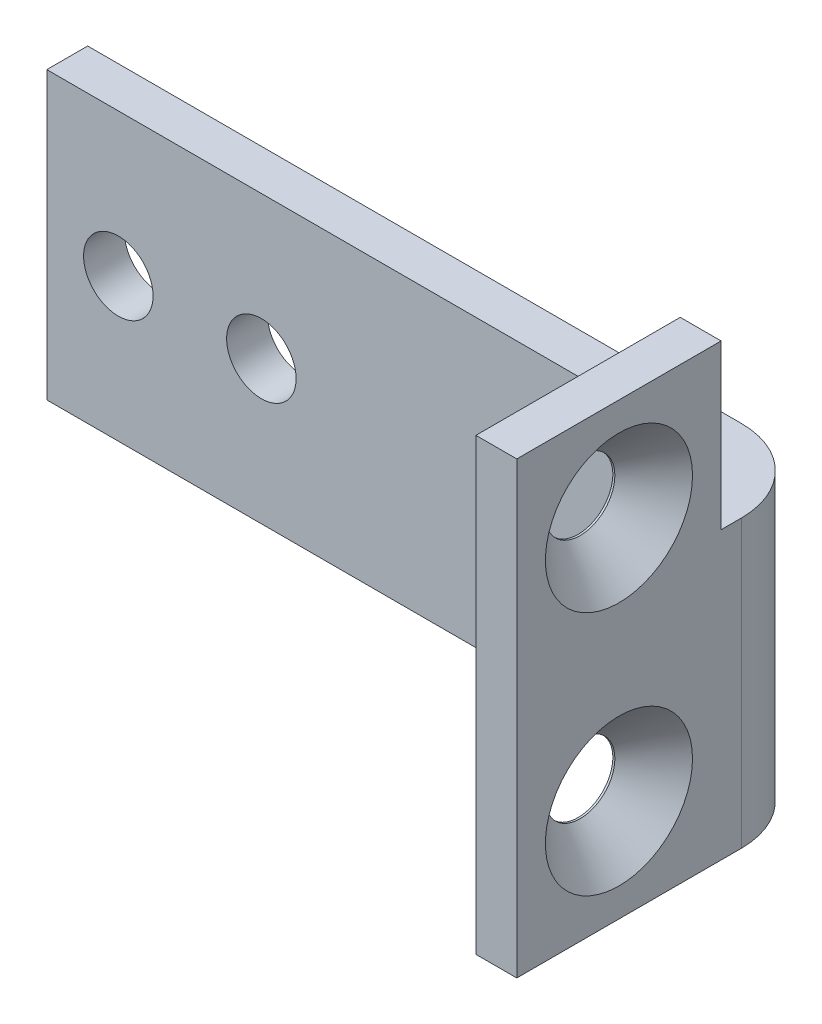
ISO-10303-21;
HEADER;
FILE_DESCRIPTION(('STEP AP214'),'2;1');
FILE_NAME('part.step','',(''),(''),'','','');
FILE_SCHEMA(('AUTOMOTIVE_DESIGN { 1 0 10303 214 1 1 1 1 }'));
ENDSEC;
DATA;
#1=APPLICATION_CONTEXT('core data for automotive mechanical design processes');
#2=APPLICATION_PROTOCOL_DEFINITION('international standard','automotive_design',2000,#1);
#3=PRODUCT_CONTEXT('',#1,'mechanical');
#4=PRODUCT('Part','Part','',(#3));
#5=PRODUCT_RELATED_PRODUCT_CATEGORY('part','',(#4));
#6=PRODUCT_DEFINITION_FORMATION('','',#4);
#7=PRODUCT_DEFINITION_CONTEXT('part definition',#1,'design');
#8=PRODUCT_DEFINITION('design','',#6,#7);
#9=PRODUCT_DEFINITION_SHAPE('','',#8);
#10=(LENGTH_UNIT() NAMED_UNIT(*) SI_UNIT(.MILLI.,.METRE.));
#11=(NAMED_UNIT(*) PLANE_ANGLE_UNIT() SI_UNIT($,.RADIAN.));
#12=(NAMED_UNIT(*) SI_UNIT($,.STERADIAN.) SOLID_ANGLE_UNIT());
#13=UNCERTAINTY_MEASURE_WITH_UNIT(LENGTH_MEASURE(1.E-05),#10,'distance_accuracy_value','');
#14=(GEOMETRIC_REPRESENTATION_CONTEXT(3) GLOBAL_UNCERTAINTY_ASSIGNED_CONTEXT((#13)) GLOBAL_UNIT_ASSIGNED_CONTEXT((#10,
#11,#12)) REPRESENTATION_CONTEXT('',''));
#15=CARTESIAN_POINT('',(0.,0.,0.));
#16=DIRECTION('',(0.,0.,1.));
#17=DIRECTION('',(1.,0.,0.));
#18=AXIS2_PLACEMENT_3D('',#15,#16,#17);
#19=CARTESIAN_POINT('',(17.9,-2.,9.));
#20=DIRECTION('',(-1.,0.,0.));
#21=DIRECTION('',(0.,0.,1.));
#22=AXIS2_PLACEMENT_3D('',#19,#20,#21);
#23=CYLINDRICAL_SURFACE('',#22,1.7);
#24=CARTESIAN_POINT('',(16.0999999999945,-2.,9.));
#25=DIRECTION('',(1.,0.,0.));
#26=DIRECTION('',(0.,0.877582561884015,-0.479425538615841));
#27=AXIS2_PLACEMENT_3D('',#24,#25,#26);
#28=CIRCLE('',#27,1.70000000001516);
#29=CARTESIAN_POINT('',(16.0999999999945,-0.508109644783872,8.1849765843458));
#30=VERTEX_POINT('',#29);
#31=EDGE_CURVE('E155',#30,#30,#28,.T.);
#32=ORIENTED_EDGE('',*,*,#31,.T.);
#33=EDGE_LOOP('',(#32));
#34=FACE_BOUND('',#33,.T.);
#35=CARTESIAN_POINT('',(16.,-2.,9.));
#36=DIRECTION('',(-1.,0.,0.));
#37=DIRECTION('',(0.,0.,1.));
#38=AXIS2_PLACEMENT_3D('',#35,#36,#37);
#39=CIRCLE('',#38,1.7);
#40=CARTESIAN_POINT('',(16.,-2.,10.7));
#41=VERTEX_POINT('',#40);
#42=EDGE_CURVE('E18',#41,#41,#39,.T.);
#43=ORIENTED_EDGE('',*,*,#42,.T.);
#44=EDGE_LOOP('',(#43));
#45=FACE_BOUND('',#44,.T.);
#46=ADVANCED_FACE('F15',(#34,#45),#23,.F.);
#47=CARTESIAN_POINT('',(17.9,10.,9.));
#48=DIRECTION('',(-1.,0.,0.));
#49=DIRECTION('',(0.,0.,1.));
#50=AXIS2_PLACEMENT_3D('',#47,#48,#49);
#51=CYLINDRICAL_SURFACE('',#50,1.7);
#52=CARTESIAN_POINT('',(16.0999999999945,10.,9.));
#53=DIRECTION('',(1.,0.,0.));
#54=DIRECTION('',(0.,0.877582561884077,-0.479425538615728));
#55=AXIS2_PLACEMENT_3D('',#52,#53,#54);
#56=CIRCLE('',#55,1.70000000001556);
#57=CARTESIAN_POINT('',(16.0999999999945,11.4918903552166,8.1849765843458));
#58=VERTEX_POINT('',#57);
#59=EDGE_CURVE('E152',#58,#58,#56,.T.);
#60=ORIENTED_EDGE('',*,*,#59,.T.);
#61=EDGE_LOOP('',(#60));
#62=FACE_BOUND('',#61,.T.);
#63=CARTESIAN_POINT('',(16.,10.,9.));
#64=DIRECTION('',(-1.,0.,0.));
#65=DIRECTION('',(0.,0.,1.));
#66=AXIS2_PLACEMENT_3D('',#63,#64,#65);
#67=CIRCLE('',#66,1.7);
#68=CARTESIAN_POINT('',(16.,10.,10.7));
#69=VERTEX_POINT('',#68);
#70=EDGE_CURVE('E129',#69,#69,#67,.T.);
#71=ORIENTED_EDGE('',*,*,#70,.T.);
#72=EDGE_LOOP('',(#71));
#73=FACE_BOUND('',#72,.T.);
#74=ADVANCED_FACE('F235',(#62,#73),#51,.F.);
#75=CARTESIAN_POINT('',(0.,15.,0.));
#76=DIRECTION('',(0.,-1.,0.));
#77=DIRECTION('',(0.,0.,-1.));
#78=AXIS2_PLACEMENT_3D('',#75,#76,#77);
#79=PLANE('',#78);
#80=DIRECTION('',(0.,0.,-1.));
#81=VECTOR('',#80,1.);
#82=CARTESIAN_POINT('',(16.,15.,3.));
#83=LINE('',#82,#81);
#84=CARTESIAN_POINT('',(16.,15.,4.));
#85=VERTEX_POINT('',#84);
#86=CARTESIAN_POINT('',(16.,15.,14.));
#87=VERTEX_POINT('',#86);
#88=EDGE_CURVE('E138',#85,#87,#83,.F.);
#89=ORIENTED_EDGE('',*,*,#88,.T.);
#90=DIRECTION('',(-1.,0.,0.));
#91=VECTOR('',#90,1.);
#92=CARTESIAN_POINT('',(16.,15.,14.));
#93=LINE('',#92,#91);
#94=CARTESIAN_POINT('',(18.,15.,14.));
#95=VERTEX_POINT('',#94);
#96=EDGE_CURVE('E135',#87,#95,#93,.F.);
#97=ORIENTED_EDGE('',*,*,#96,.T.);
#98=DIRECTION('',(0.,0.,1.));
#99=VECTOR('',#98,1.);
#100=CARTESIAN_POINT('',(18.,15.,14.));
#101=LINE('',#100,#99);
#102=CARTESIAN_POINT('',(18.,15.,4.));
#103=VERTEX_POINT('',#102);
#104=EDGE_CURVE('E128',#95,#103,#101,.F.);
#105=ORIENTED_EDGE('',*,*,#104,.T.);
#106=DIRECTION('',(-1.,0.,0.));
#107=VECTOR('',#106,1.);
#108=CARTESIAN_POINT('',(0.,15.,4.));
#109=LINE('',#108,#107);
#110=EDGE_CURVE('E147',#85,#103,#109,.F.);
#111=ORIENTED_EDGE('',*,*,#110,.F.);
#112=EDGE_LOOP('',(#89,#97,#105,#111));
#113=FACE_BOUND('',#112,.T.);
#114=ADVANCED_FACE('F232',(#113),#79,.F.);
#115=CARTESIAN_POINT('',(17.9999999999154,-2.,9.));
#116=DIRECTION('',(1.,0.,0.));
#117=DIRECTION('',(0.,0.,-1.));
#118=AXIS2_PLACEMENT_3D('',#115,#116,#117);
#119=CONICAL_SURFACE('',#118,3.59999999992622,0.785398163396597);
#120=ORIENTED_EDGE('',*,*,#31,.F.);
#121=EDGE_LOOP('',(#120));
#122=FACE_BOUND('',#121,.T.);
#123=CARTESIAN_POINT('',(18.0000000000291,-2.,9.));
#124=DIRECTION('',(1.,0.,0.));
#125=DIRECTION('',(0.,0.,-1.));
#126=AXIS2_PLACEMENT_3D('',#123,#124,#125);
#127=CIRCLE('',#126,3.60000000003991);
#128=CARTESIAN_POINT('',(18.0000000000291,-2.,5.39999999996009));
#129=VERTEX_POINT('',#128);
#130=EDGE_CURVE('E126',#129,#129,#127,.T.);
#131=ORIENTED_EDGE('',*,*,#130,.T.);
#132=EDGE_LOOP('',(#131));
#133=FACE_BOUND('',#132,.T.);
#134=ADVANCED_FACE('F234',(#122,#133),#119,.F.);
#135=CARTESIAN_POINT('',(18.0000000000291,10.,9.));
#136=DIRECTION('',(1.,0.,0.));
#137=DIRECTION('',(0.,0.,-1.));
#138=AXIS2_PLACEMENT_3D('',#135,#136,#137);
#139=CONICAL_SURFACE('',#138,3.60000000005364,0.785398163400107);
#140=ORIENTED_EDGE('',*,*,#59,.F.);
#141=EDGE_LOOP('',(#140));
#142=FACE_BOUND('',#141,.T.);
#143=CARTESIAN_POINT('',(18.0000000000291,10.,9.));
#144=DIRECTION('',(1.,0.,0.));
#145=DIRECTION('',(0.,0.,-1.));
#146=AXIS2_PLACEMENT_3D('',#143,#144,#145);
#147=CIRCLE('',#146,3.60000000005364);
#148=CARTESIAN_POINT('',(18.0000000000291,10.,5.39999999994636));
#149=VERTEX_POINT('',#148);
#150=EDGE_CURVE('E104',#149,#149,#147,.T.);
#151=ORIENTED_EDGE('',*,*,#150,.T.);
#152=EDGE_LOOP('',(#151));
#153=FACE_BOUND('',#152,.T.);
#154=ADVANCED_FACE('F242',(#142,#153),#139,.F.);
#155=CARTESIAN_POINT('',(0.,7.,4.));
#156=DIRECTION('',(0.,0.,-1.));
#157=DIRECTION('',(-1.,0.,0.));
#158=AXIS2_PLACEMENT_3D('',#155,#156,#157);
#159=PLANE('',#158);
#160=DIRECTION('',(0.,1.,0.));
#161=VECTOR('',#160,1.);
#162=CARTESIAN_POINT('',(18.,0.,4.));
#163=LINE('',#162,#161);
#164=CARTESIAN_POINT('',(18.,7.,4.));
#165=VERTEX_POINT('',#164);
#166=EDGE_CURVE('E187',#103,#165,#163,.F.);
#167=ORIENTED_EDGE('',*,*,#166,.T.);
#168=DIRECTION('',(1.,0.,0.));
#169=VECTOR('',#168,1.);
#170=CARTESIAN_POINT('',(0.,7.,4.));
#171=LINE('',#170,#169);
#172=CARTESIAN_POINT('',(16.,7.,4.));
#173=VERTEX_POINT('',#172);
#174=EDGE_CURVE('E113',#165,#173,#171,.F.);
#175=ORIENTED_EDGE('',*,*,#174,.T.);
#176=DIRECTION('',(0.,1.,0.));
#177=VECTOR('',#176,1.);
#178=CARTESIAN_POINT('',(16.,0.,4.));
#179=LINE('',#178,#177);
#180=EDGE_CURVE('E141',#173,#85,#179,.T.);
#181=ORIENTED_EDGE('',*,*,#180,.T.);
#182=ORIENTED_EDGE('',*,*,#110,.T.);
#183=EDGE_LOOP('',(#167,#175,#181,#182));
#184=FACE_BOUND('',#183,.T.);
#185=ADVANCED_FACE('F229',(#184),#159,.T.);
#186=CARTESIAN_POINT('',(16.,0.,3.));
#187=DIRECTION('',(1.,0.,0.));
#188=DIRECTION('',(0.,0.,-1.));
#189=AXIS2_PLACEMENT_3D('',#186,#187,#188);
#190=PLANE('',#189);
#191=ORIENTED_EDGE('',*,*,#70,.F.);
#192=EDGE_LOOP('',(#191));
#193=FACE_BOUND('',#192,.T.);
#194=ORIENTED_EDGE('',*,*,#42,.F.);
#195=EDGE_LOOP('',(#194));
#196=FACE_BOUND('',#195,.T.);
#197=DIRECTION('',(0.,0.,1.));
#198=VECTOR('',#197,1.);
#199=CARTESIAN_POINT('',(16.,-7.,-1.));
#200=LINE('',#199,#198);
#201=CARTESIAN_POINT('',(16.,-7.,3.));
#202=VERTEX_POINT('',#201);
#203=CARTESIAN_POINT('',(16.,-7.,14.));
#204=VERTEX_POINT('',#203);
#205=EDGE_CURVE('E173',#202,#204,#200,.T.);
#206=ORIENTED_EDGE('',*,*,#205,.T.);
#207=DIRECTION('',(0.,1.,0.));
#208=VECTOR('',#207,1.);
#209=CARTESIAN_POINT('',(16.,0.,14.));
#210=LINE('',#209,#208);
#211=EDGE_CURVE('E131',#204,#87,#210,.T.);
#212=ORIENTED_EDGE('',*,*,#211,.T.);
#213=ORIENTED_EDGE('',*,*,#88,.F.);
#214=ORIENTED_EDGE('',*,*,#180,.F.);
#215=DIRECTION('',(0.,0.,-1.));
#216=VECTOR('',#215,1.);
#217=CARTESIAN_POINT('',(16.,7.,4.));
#218=LINE('',#217,#216);
#219=CARTESIAN_POINT('',(16.,7.,3.));
#220=VERTEX_POINT('',#219);
#221=EDGE_CURVE('E118',#173,#220,#218,.T.);
#222=ORIENTED_EDGE('',*,*,#221,.T.);
#223=DIRECTION('',(0.,-1.,0.));
#224=VECTOR('',#223,1.);
#225=CARTESIAN_POINT('',(16.,0.,3.));
#226=LINE('',#225,#224);
#227=EDGE_CURVE('E174',#220,#202,#226,.T.);
#228=ORIENTED_EDGE('',*,*,#227,.T.);
#229=EDGE_LOOP('',(#206,#212,#213,#214,#222,#228));
#230=FACE_BOUND('',#229,.T.);
#231=ADVANCED_FACE('F230',(#193,#196,#230),#190,.F.);
#232=CARTESIAN_POINT('',(16.,0.,14.));
#233=DIRECTION('',(0.,0.,-1.));
#234=DIRECTION('',(-1.,0.,0.));
#235=AXIS2_PLACEMENT_3D('',#232,#233,#234);
#236=PLANE('',#235);
#237=DIRECTION('',(0.,1.,0.));
#238=VECTOR('',#237,1.);
#239=CARTESIAN_POINT('',(18.,0.,14.));
#240=LINE('',#239,#238);
#241=CARTESIAN_POINT('',(18.,-7.,14.));
#242=VERTEX_POINT('',#241);
#243=EDGE_CURVE('E189',#242,#95,#240,.T.);
#244=ORIENTED_EDGE('',*,*,#243,.T.);
#245=ORIENTED_EDGE('',*,*,#96,.F.);
#246=ORIENTED_EDGE('',*,*,#211,.F.);
#247=DIRECTION('',(1.,0.,0.));
#248=VECTOR('',#247,1.);
#249=CARTESIAN_POINT('',(0.,-7.,14.));
#250=LINE('',#249,#248);
#251=EDGE_CURVE('E179',#204,#242,#250,.T.);
#252=ORIENTED_EDGE('',*,*,#251,.T.);
#253=EDGE_LOOP('',(#244,#245,#246,#252));
#254=FACE_BOUND('',#253,.T.);
#255=ADVANCED_FACE('F231',(#254),#236,.F.);
#256=CARTESIAN_POINT('',(18.,0.,14.));
#257=DIRECTION('',(-1.,0.,0.));
#258=DIRECTION('',(0.,0.,1.));
#259=AXIS2_PLACEMENT_3D('',#256,#257,#258);
#260=PLANE('',#259);
#261=ORIENTED_EDGE('',*,*,#150,.F.);
#262=EDGE_LOOP('',(#261));
#263=FACE_BOUND('',#262,.T.);
#264=ORIENTED_EDGE('',*,*,#130,.F.);
#265=EDGE_LOOP('',(#264));
#266=FACE_BOUND('',#265,.T.);
#267=ORIENTED_EDGE('',*,*,#243,.F.);
#268=DIRECTION('',(0.,0.,1.));
#269=VECTOR('',#268,1.);
#270=CARTESIAN_POINT('',(18.,-7.,-1.));
#271=LINE('',#270,#269);
#272=CARTESIAN_POINT('',(18.,-7.,3.));
#273=VERTEX_POINT('',#272);
#274=EDGE_CURVE('E102',#242,#273,#271,.F.);
#275=ORIENTED_EDGE('',*,*,#274,.T.);
#276=DIRECTION('',(0.,-1.,0.));
#277=VECTOR('',#276,1.);
#278=CARTESIAN_POINT('',(18.,0.,3.));
#279=LINE('',#278,#277);
#280=CARTESIAN_POINT('',(18.,7.,3.));
#281=VERTEX_POINT('',#280);
#282=EDGE_CURVE('E96',#281,#273,#279,.T.);
#283=ORIENTED_EDGE('',*,*,#282,.F.);
#284=DIRECTION('',(0.,0.,-1.));
#285=VECTOR('',#284,1.);
#286=CARTESIAN_POINT('',(18.,7.,4.));
#287=LINE('',#286,#285);
#288=EDGE_CURVE('E100',#281,#165,#287,.F.);
#289=ORIENTED_EDGE('',*,*,#288,.T.);
#290=ORIENTED_EDGE('',*,*,#166,.F.);
#291=ORIENTED_EDGE('',*,*,#104,.F.);
#292=EDGE_LOOP('',(#267,#275,#283,#289,#290,#291));
#293=FACE_BOUND('',#292,.T.);
#294=ADVANCED_FACE('F98',(#263,#266,#293),#260,.F.);
#295=CARTESIAN_POINT('',(14.,0.,3.));
#296=DIRECTION('',(0.,-1.,0.));
#297=DIRECTION('',(0.,0.,-1.));
#298=AXIS2_PLACEMENT_3D('',#295,#296,#297);
#299=CYLINDRICAL_SURFACE('',#298,4.);
#300=CARTESIAN_POINT('',(14.,-7.,3.));
#301=DIRECTION('',(0.,-1.,0.));
#302=DIRECTION('',(0.,0.,-1.));
#303=AXIS2_PLACEMENT_3D('',#300,#301,#302);
#304=CIRCLE('',#303,4.);
#305=CARTESIAN_POINT('',(14.,-7.,-1.));
#306=VERTEX_POINT('',#305);
#307=EDGE_CURVE('E169',#273,#306,#304,.F.);
#308=ORIENTED_EDGE('',*,*,#307,.T.);
#309=DIRECTION('',(0.,1.,0.));
#310=VECTOR('',#309,1.);
#311=CARTESIAN_POINT('',(14.,0.,-1.));
#312=LINE('',#311,#310);
#313=CARTESIAN_POINT('',(14.,7.,-1.));
#314=VERTEX_POINT('',#313);
#315=EDGE_CURVE('E90',#306,#314,#312,.T.);
#316=ORIENTED_EDGE('',*,*,#315,.T.);
#317=CARTESIAN_POINT('',(14.,7.,3.));
#318=DIRECTION('',(0.,-1.,0.));
#319=DIRECTION('',(0.,0.,-1.));
#320=AXIS2_PLACEMENT_3D('',#317,#318,#319);
#321=CIRCLE('',#320,4.);
#322=EDGE_CURVE('E109',#314,#281,#321,.T.);
#323=ORIENTED_EDGE('',*,*,#322,.T.);
#324=ORIENTED_EDGE('',*,*,#282,.T.);
#325=EDGE_LOOP('',(#308,#316,#323,#324));
#326=FACE_BOUND('',#325,.T.);
#327=ADVANCED_FACE('F115',(#326),#299,.T.);
#328=CARTESIAN_POINT('',(14.,0.,-1.));
#329=DIRECTION('',(0.,0.,1.));
#330=DIRECTION('',(1.,0.,0.));
#331=AXIS2_PLACEMENT_3D('',#328,#329,#330);
#332=PLANE('',#331);
#333=CARTESIAN_POINT('',(-14.5,0.,-1.));
#334=DIRECTION('',(0.,0.,1.));
#335=DIRECTION('',(1.,0.,0.));
#336=AXIS2_PLACEMENT_3D('',#333,#334,#335);
#337=CIRCLE('',#336,1.7);
#338=CARTESIAN_POINT('',(-12.8,0.,-1.));
#339=VERTEX_POINT('',#338);
#340=EDGE_CURVE('E161',#339,#339,#337,.T.);
#341=ORIENTED_EDGE('',*,*,#340,.T.);
#342=EDGE_LOOP('',(#341));
#343=FACE_BOUND('',#342,.T.);
#344=CARTESIAN_POINT('',(-7.5,0.,-1.));
#345=DIRECTION('',(0.,0.,1.));
#346=DIRECTION('',(1.,0.,0.));
#347=AXIS2_PLACEMENT_3D('',#344,#345,#346);
#348=CIRCLE('',#347,1.7);
#349=CARTESIAN_POINT('',(-5.8,0.,-1.));
#350=VERTEX_POINT('',#349);
#351=EDGE_CURVE('E165',#350,#350,#348,.T.);
#352=ORIENTED_EDGE('',*,*,#351,.T.);
#353=EDGE_LOOP('',(#352));
#354=FACE_BOUND('',#353,.T.);
#355=DIRECTION('',(1.,0.,0.));
#356=VECTOR('',#355,1.);
#357=CARTESIAN_POINT('',(0.,-7.,-1.));
#358=LINE('',#357,#356);
#359=CARTESIAN_POINT('',(-18.,-7.,-1.));
#360=VERTEX_POINT('',#359);
#361=EDGE_CURVE('E170',#306,#360,#358,.F.);
#362=ORIENTED_EDGE('',*,*,#361,.T.);
#363=DIRECTION('',(0.,1.,0.));
#364=VECTOR('',#363,1.);
#365=CARTESIAN_POINT('',(-18.,0.,-1.));
#366=LINE('',#365,#364);
#367=CARTESIAN_POINT('',(-18.,7.,-1.));
#368=VERTEX_POINT('',#367);
#369=EDGE_CURVE('E168',#360,#368,#366,.T.);
#370=ORIENTED_EDGE('',*,*,#369,.T.);
#371=DIRECTION('',(1.,0.,0.));
#372=VECTOR('',#371,1.);
#373=CARTESIAN_POINT('',(0.,7.,-1.));
#374=LINE('',#373,#372);
#375=EDGE_CURVE('E116',#368,#314,#374,.T.);
#376=ORIENTED_EDGE('',*,*,#375,.T.);
#377=ORIENTED_EDGE('',*,*,#315,.F.);
#378=EDGE_LOOP('',(#362,#370,#376,#377));
#379=FACE_BOUND('',#378,.T.);
#380=ADVANCED_FACE('F217',(#343,#354,#379),#332,.F.);
#381=CARTESIAN_POINT('',(0.,7.,4.));
#382=DIRECTION('',(0.,-1.,0.));
#383=DIRECTION('',(0.,0.,-1.));
#384=AXIS2_PLACEMENT_3D('',#381,#382,#383);
#385=PLANE('',#384);
#386=ORIENTED_EDGE('',*,*,#288,.F.);
#387=ORIENTED_EDGE('',*,*,#322,.F.);
#388=ORIENTED_EDGE('',*,*,#375,.F.);
#389=DIRECTION('',(0.,0.,-1.));
#390=VECTOR('',#389,1.);
#391=CARTESIAN_POINT('',(-18.,7.,-1.));
#392=LINE('',#391,#390);
#393=CARTESIAN_POINT('',(-18.,7.,1.));
#394=VERTEX_POINT('',#393);
#395=EDGE_CURVE('E209',#368,#394,#392,.F.);
#396=ORIENTED_EDGE('',*,*,#395,.T.);
#397=DIRECTION('',(-1.,0.,0.));
#398=VECTOR('',#397,1.);
#399=CARTESIAN_POINT('',(-18.,7.,1.));
#400=LINE('',#399,#398);
#401=CARTESIAN_POINT('',(14.,7.,1.));
#402=VERTEX_POINT('',#401);
#403=EDGE_CURVE('E164',#394,#402,#400,.F.);
#404=ORIENTED_EDGE('',*,*,#403,.T.);
#405=CARTESIAN_POINT('',(14.,7.,3.));
#406=DIRECTION('',(0.,-1.,0.));
#407=DIRECTION('',(0.,0.,-1.));
#408=AXIS2_PLACEMENT_3D('',#405,#406,#407);
#409=CIRCLE('',#408,2.);
#410=EDGE_CURVE('E122',#402,#220,#409,.T.);
#411=ORIENTED_EDGE('',*,*,#410,.T.);
#412=ORIENTED_EDGE('',*,*,#221,.F.);
#413=ORIENTED_EDGE('',*,*,#174,.F.);
#414=EDGE_LOOP('',(#386,#387,#388,#396,#404,#411,#412,#413));
#415=FACE_BOUND('',#414,.T.);
#416=ADVANCED_FACE('F108',(#415),#385,.F.);
#417=CARTESIAN_POINT('',(14.,0.,3.));
#418=DIRECTION('',(0.,-1.,0.));
#419=DIRECTION('',(0.,0.,-1.));
#420=AXIS2_PLACEMENT_3D('',#417,#418,#419);
#421=CYLINDRICAL_SURFACE('',#420,2.);
#422=CARTESIAN_POINT('',(14.,-7.,3.));
#423=DIRECTION('',(0.,-1.,0.));
#424=DIRECTION('',(0.,0.,-1.));
#425=AXIS2_PLACEMENT_3D('',#422,#423,#424);
#426=CIRCLE('',#425,2.);
#427=CARTESIAN_POINT('',(14.,-7.,1.));
#428=VERTEX_POINT('',#427);
#429=EDGE_CURVE('E171',#428,#202,#426,.T.);
#430=ORIENTED_EDGE('',*,*,#429,.T.);
#431=ORIENTED_EDGE('',*,*,#227,.F.);
#432=ORIENTED_EDGE('',*,*,#410,.F.);
#433=DIRECTION('',(0.,1.,0.));
#434=VECTOR('',#433,1.);
#435=CARTESIAN_POINT('',(14.,0.,1.));
#436=LINE('',#435,#434);
#437=EDGE_CURVE('E202',#402,#428,#436,.F.);
#438=ORIENTED_EDGE('',*,*,#437,.T.);
#439=EDGE_LOOP('',(#430,#431,#432,#438));
#440=FACE_BOUND('',#439,.T.);
#441=ADVANCED_FACE('F227',(#440),#421,.F.);
#442=CARTESIAN_POINT('',(0.,-7.,-1.));
#443=DIRECTION('',(0.,1.,0.));
#444=DIRECTION('',(0.,0.,1.));
#445=AXIS2_PLACEMENT_3D('',#442,#443,#444);
#446=PLANE('',#445);
#447=ORIENTED_EDGE('',*,*,#307,.F.);
#448=ORIENTED_EDGE('',*,*,#274,.F.);
#449=ORIENTED_EDGE('',*,*,#251,.F.);
#450=ORIENTED_EDGE('',*,*,#205,.F.);
#451=ORIENTED_EDGE('',*,*,#429,.F.);
#452=DIRECTION('',(-1.,0.,0.));
#453=VECTOR('',#452,1.);
#454=CARTESIAN_POINT('',(-18.,-7.,1.));
#455=LINE('',#454,#453);
#456=CARTESIAN_POINT('',(-18.,-7.,1.));
#457=VERTEX_POINT('',#456);
#458=EDGE_CURVE('E204',#428,#457,#455,.T.);
#459=ORIENTED_EDGE('',*,*,#458,.T.);
#460=DIRECTION('',(0.,0.,-1.));
#461=VECTOR('',#460,1.);
#462=CARTESIAN_POINT('',(-18.,-7.,-1.));
#463=LINE('',#462,#461);
#464=EDGE_CURVE('E33',#457,#360,#463,.T.);
#465=ORIENTED_EDGE('',*,*,#464,.T.);
#466=ORIENTED_EDGE('',*,*,#361,.F.);
#467=EDGE_LOOP('',(#447,#448,#449,#450,#451,#459,#465,#466));
#468=FACE_BOUND('',#467,.T.);
#469=ADVANCED_FACE('F222',(#468),#446,.F.);
#470=CARTESIAN_POINT('',(-18.,0.,-1.));
#471=DIRECTION('',(1.,0.,0.));
#472=DIRECTION('',(0.,0.,-1.));
#473=AXIS2_PLACEMENT_3D('',#470,#471,#472);
#474=PLANE('',#473);
#475=ORIENTED_EDGE('',*,*,#464,.F.);
#476=DIRECTION('',(0.,1.,0.));
#477=VECTOR('',#476,1.);
#478=CARTESIAN_POINT('',(-18.,0.,1.));
#479=LINE('',#478,#477);
#480=EDGE_CURVE('E160',#457,#394,#479,.T.);
#481=ORIENTED_EDGE('',*,*,#480,.T.);
#482=ORIENTED_EDGE('',*,*,#395,.F.);
#483=ORIENTED_EDGE('',*,*,#369,.F.);
#484=EDGE_LOOP('',(#475,#481,#482,#483));
#485=FACE_BOUND('',#484,.T.);
#486=ADVANCED_FACE('F220',(#485),#474,.F.);
#487=CARTESIAN_POINT('',(-7.5,0.,-0.9));
#488=DIRECTION('',(0.,0.,1.));
#489=DIRECTION('',(1.,0.,0.));
#490=AXIS2_PLACEMENT_3D('',#487,#488,#489);
#491=CYLINDRICAL_SURFACE('',#490,1.7);
#492=CARTESIAN_POINT('',(-7.5,0.,1.));
#493=DIRECTION('',(0.,0.,1.));
#494=DIRECTION('',(1.,0.,0.));
#495=AXIS2_PLACEMENT_3D('',#492,#493,#494);
#496=CIRCLE('',#495,1.7);
#497=CARTESIAN_POINT('',(-5.8,0.,1.));
#498=VERTEX_POINT('',#497);
#499=EDGE_CURVE('E24',#498,#498,#496,.T.);
#500=ORIENTED_EDGE('',*,*,#499,.T.);
#501=EDGE_LOOP('',(#500));
#502=FACE_BOUND('',#501,.T.);
#503=ORIENTED_EDGE('',*,*,#351,.F.);
#504=EDGE_LOOP('',(#503));
#505=FACE_BOUND('',#504,.T.);
#506=ADVANCED_FACE('F253',(#502,#505),#491,.F.);
#507=CARTESIAN_POINT('',(-14.5,0.,-0.9));
#508=DIRECTION('',(0.,0.,1.));
#509=DIRECTION('',(1.,0.,0.));
#510=AXIS2_PLACEMENT_3D('',#507,#508,#509);
#511=CYLINDRICAL_SURFACE('',#510,1.7);
#512=CARTESIAN_POINT('',(-14.5,0.,1.));
#513=DIRECTION('',(0.,0.,1.));
#514=DIRECTION('',(1.,0.,0.));
#515=AXIS2_PLACEMENT_3D('',#512,#513,#514);
#516=CIRCLE('',#515,1.7);
#517=CARTESIAN_POINT('',(-12.8,0.,1.));
#518=VERTEX_POINT('',#517);
#519=EDGE_CURVE('E10',#518,#518,#516,.T.);
#520=ORIENTED_EDGE('',*,*,#519,.T.);
#521=EDGE_LOOP('',(#520));
#522=FACE_BOUND('',#521,.T.);
#523=ORIENTED_EDGE('',*,*,#340,.F.);
#524=EDGE_LOOP('',(#523));
#525=FACE_BOUND('',#524,.T.);
#526=ADVANCED_FACE('F247',(#522,#525),#511,.F.);
#527=CARTESIAN_POINT('',(-18.,0.,1.));
#528=DIRECTION('',(0.,0.,-1.));
#529=DIRECTION('',(-1.,0.,0.));
#530=AXIS2_PLACEMENT_3D('',#527,#528,#529);
#531=PLANE('',#530);
#532=ORIENTED_EDGE('',*,*,#519,.F.);
#533=EDGE_LOOP('',(#532));
#534=FACE_BOUND('',#533,.T.);
#535=ORIENTED_EDGE('',*,*,#499,.F.);
#536=EDGE_LOOP('',(#535));
#537=FACE_BOUND('',#536,.T.);
#538=ORIENTED_EDGE('',*,*,#458,.F.);
#539=ORIENTED_EDGE('',*,*,#437,.F.);
#540=ORIENTED_EDGE('',*,*,#403,.F.);
#541=ORIENTED_EDGE('',*,*,#480,.F.);
#542=EDGE_LOOP('',(#538,#539,#540,#541));
#543=FACE_BOUND('',#542,.T.);
#544=ADVANCED_FACE('F226',(#534,#537,#543),#531,.F.);
#545=CLOSED_SHELL('',(#46,#74,#114,#134,#154,#185,#231,#255,#294,#327,#380,#416,#441,#469,#486,
#506,#526,#544));
#546=MANIFOLD_SOLID_BREP('B1',#545);
#547=ADVANCED_BREP_SHAPE_REPRESENTATION('',(#18,#546),#14);
#548=SHAPE_DEFINITION_REPRESENTATION(#9,#547);
ENDSEC;
END-ISO-10303-21;
